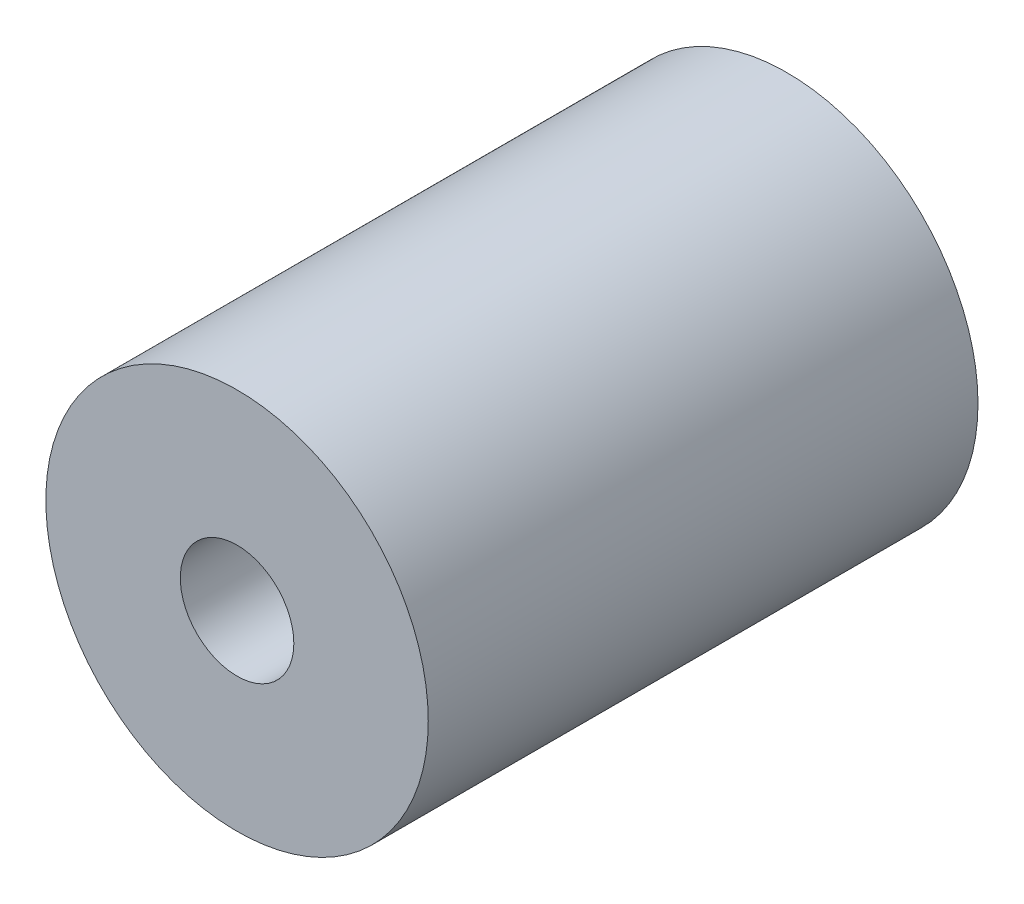
ISO-10303-21;
HEADER;
FILE_DESCRIPTION(('STEP AP214'),'2;1');
FILE_NAME('part.step','',(''),(''),'','','');
FILE_SCHEMA(('AUTOMOTIVE_DESIGN { 1 0 10303 214 1 1 1 1 }'));
ENDSEC;
DATA;
#1=APPLICATION_CONTEXT('core data for automotive mechanical design processes');
#2=APPLICATION_PROTOCOL_DEFINITION('international standard','automotive_design',2000,#1);
#3=PRODUCT_CONTEXT('',#1,'mechanical');
#4=PRODUCT('Part','Part','',(#3));
#5=PRODUCT_RELATED_PRODUCT_CATEGORY('part','',(#4));
#6=PRODUCT_DEFINITION_FORMATION('','',#4);
#7=PRODUCT_DEFINITION_CONTEXT('part definition',#1,'design');
#8=PRODUCT_DEFINITION('design','',#6,#7);
#9=PRODUCT_DEFINITION_SHAPE('','',#8);
#10=(LENGTH_UNIT() NAMED_UNIT(*) SI_UNIT(.MILLI.,.METRE.));
#11=(NAMED_UNIT(*) PLANE_ANGLE_UNIT() SI_UNIT($,.RADIAN.));
#12=(NAMED_UNIT(*) SI_UNIT($,.STERADIAN.) SOLID_ANGLE_UNIT());
#13=UNCERTAINTY_MEASURE_WITH_UNIT(LENGTH_MEASURE(1.E-05),#10,'distance_accuracy_value','');
#14=(GEOMETRIC_REPRESENTATION_CONTEXT(3) GLOBAL_UNCERTAINTY_ASSIGNED_CONTEXT((#13)) GLOBAL_UNIT_ASSIGNED_CONTEXT((#10,
#11,#12)) REPRESENTATION_CONTEXT('',''));
#15=CARTESIAN_POINT('',(0.,0.,0.));
#16=DIRECTION('',(0.,0.,1.));
#17=DIRECTION('',(1.,0.,0.));
#18=AXIS2_PLACEMENT_3D('',#15,#16,#17);
#19=CARTESIAN_POINT('',(0.,0.,23.));
#20=DIRECTION('',(0.,0.,1.));
#21=DIRECTION('',(1.,0.,0.));
#22=AXIS2_PLACEMENT_3D('',#19,#20,#21);
#23=PLANE('',#22);
#24=CARTESIAN_POINT('',(0.,0.,23.));
#25=DIRECTION('',(0.,0.,1.));
#26=DIRECTION('',(1.,0.,0.));
#27=AXIS2_PLACEMENT_3D('',#24,#25,#26);
#28=CIRCLE('',#27,8.);
#29=CARTESIAN_POINT('',(8.,0.,23.));
#30=VERTEX_POINT('',#29);
#31=EDGE_CURVE('E10',#30,#30,#28,.T.);
#32=ORIENTED_EDGE('',*,*,#31,.T.);
#33=EDGE_LOOP('',(#32));
#34=FACE_BOUND('',#33,.T.);
#35=CARTESIAN_POINT('',(0.,0.,23.));
#36=DIRECTION('',(0.,0.,1.));
#37=DIRECTION('',(1.,0.,0.));
#38=AXIS2_PLACEMENT_3D('',#35,#36,#37);
#39=CIRCLE('',#38,2.375);
#40=CARTESIAN_POINT('',(2.375,0.,23.));
#41=VERTEX_POINT('',#40);
#42=EDGE_CURVE('E50',#41,#41,#39,.T.);
#43=ORIENTED_EDGE('',*,*,#42,.F.);
#44=EDGE_LOOP('',(#43));
#45=FACE_BOUND('',#44,.T.);
#46=ADVANCED_FACE('F37',(#34,#45),#23,.T.);
#47=CARTESIAN_POINT('',(0.,0.,0.));
#48=DIRECTION('',(0.,0.,1.));
#49=DIRECTION('',(1.,0.,0.));
#50=AXIS2_PLACEMENT_3D('',#47,#48,#49);
#51=PLANE('',#50);
#52=CARTESIAN_POINT('',(0.,0.,0.));
#53=DIRECTION('',(0.,0.,1.));
#54=DIRECTION('',(1.,0.,0.));
#55=AXIS2_PLACEMENT_3D('',#52,#53,#54);
#56=CIRCLE('',#55,8.);
#57=CARTESIAN_POINT('',(8.,0.,0.));
#58=VERTEX_POINT('',#57);
#59=EDGE_CURVE('E41',#58,#58,#56,.T.);
#60=ORIENTED_EDGE('',*,*,#59,.F.);
#61=EDGE_LOOP('',(#60));
#62=FACE_BOUND('',#61,.T.);
#63=CARTESIAN_POINT('',(0.,0.,0.));
#64=DIRECTION('',(0.,0.,1.));
#65=DIRECTION('',(1.,0.,0.));
#66=AXIS2_PLACEMENT_3D('',#63,#64,#65);
#67=CIRCLE('',#66,2.375);
#68=CARTESIAN_POINT('',(2.375,0.,0.));
#69=VERTEX_POINT('',#68);
#70=EDGE_CURVE('E52',#69,#69,#67,.T.);
#71=ORIENTED_EDGE('',*,*,#70,.T.);
#72=EDGE_LOOP('',(#71));
#73=FACE_BOUND('',#72,.T.);
#74=ADVANCED_FACE('F64',(#62,#73),#51,.F.);
#75=CARTESIAN_POINT('',(0.,0.,23.));
#76=DIRECTION('',(0.,0.,-1.));
#77=DIRECTION('',(-1.,0.,0.));
#78=AXIS2_PLACEMENT_3D('',#75,#76,#77);
#79=CYLINDRICAL_SURFACE('',#78,8.);
#80=ORIENTED_EDGE('',*,*,#31,.F.);
#81=EDGE_LOOP('',(#80));
#82=FACE_BOUND('',#81,.T.);
#83=ORIENTED_EDGE('',*,*,#59,.T.);
#84=EDGE_LOOP('',(#83));
#85=FACE_BOUND('',#84,.T.);
#86=ADVANCED_FACE('F39',(#82,#85),#79,.T.);
#87=CARTESIAN_POINT('',(0.,0.,23.));
#88=DIRECTION('',(0.,0.,-1.));
#89=DIRECTION('',(-1.,0.,0.));
#90=AXIS2_PLACEMENT_3D('',#87,#88,#89);
#91=CYLINDRICAL_SURFACE('',#90,2.375);
#92=ORIENTED_EDGE('',*,*,#42,.T.);
#93=EDGE_LOOP('',(#92));
#94=FACE_BOUND('',#93,.T.);
#95=ORIENTED_EDGE('',*,*,#70,.F.);
#96=EDGE_LOOP('',(#95));
#97=FACE_BOUND('',#96,.T.);
#98=ADVANCED_FACE('F60',(#94,#97),#91,.F.);
#99=CLOSED_SHELL('',(#46,#74,#86,#98));
#100=MANIFOLD_SOLID_BREP('B2',#99);
#101=ADVANCED_BREP_SHAPE_REPRESENTATION('',(#18,#100),#14);
#102=SHAPE_DEFINITION_REPRESENTATION(#9,#101);
ENDSEC;
END-ISO-10303-21;
